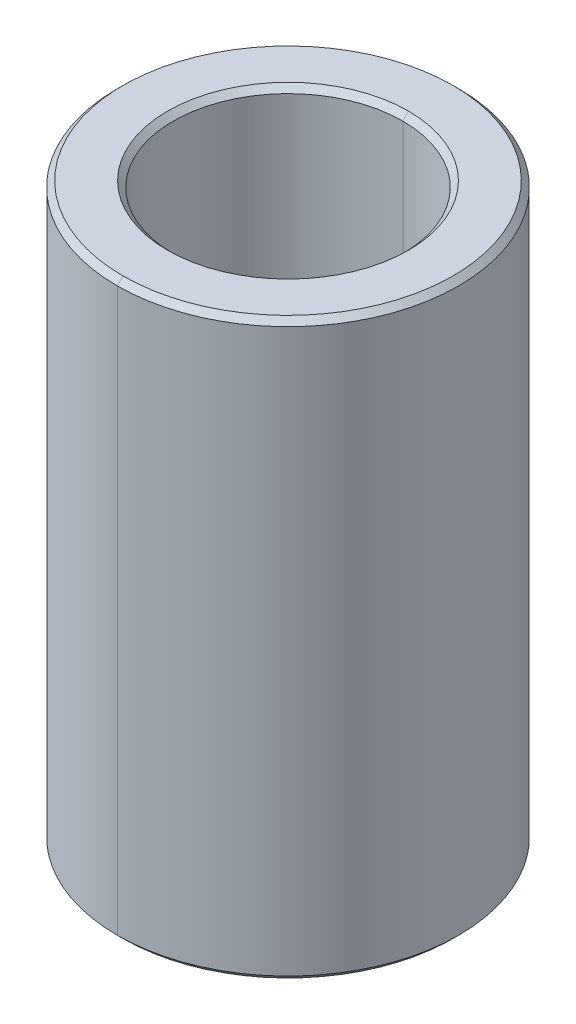
ISO-10303-21;
HEADER;
FILE_DESCRIPTION(('STEP AP214'),'2;1');
FILE_NAME('part.step','',(''),(''),'','','');
FILE_SCHEMA(('AUTOMOTIVE_DESIGN { 1 0 10303 214 1 1 1 1 }'));
ENDSEC;
DATA;
#1=APPLICATION_CONTEXT('core data for automotive mechanical design processes');
#2=APPLICATION_PROTOCOL_DEFINITION('international standard','automotive_design',2000,#1);
#3=PRODUCT_CONTEXT('',#1,'mechanical');
#4=PRODUCT('Part','Part','',(#3));
#5=PRODUCT_RELATED_PRODUCT_CATEGORY('part','',(#4));
#6=PRODUCT_DEFINITION_FORMATION('','',#4);
#7=PRODUCT_DEFINITION_CONTEXT('part definition',#1,'design');
#8=PRODUCT_DEFINITION('design','',#6,#7);
#9=PRODUCT_DEFINITION_SHAPE('','',#8);
#10=(LENGTH_UNIT() NAMED_UNIT(*) SI_UNIT(.MILLI.,.METRE.));
#11=(NAMED_UNIT(*) PLANE_ANGLE_UNIT() SI_UNIT($,.RADIAN.));
#12=(NAMED_UNIT(*) SI_UNIT($,.STERADIAN.) SOLID_ANGLE_UNIT());
#13=UNCERTAINTY_MEASURE_WITH_UNIT(LENGTH_MEASURE(1.E-05),#10,'distance_accuracy_value','');
#14=(GEOMETRIC_REPRESENTATION_CONTEXT(3) GLOBAL_UNCERTAINTY_ASSIGNED_CONTEXT((#13)) GLOBAL_UNIT_ASSIGNED_CONTEXT((#10,
#11,#12)) REPRESENTATION_CONTEXT('',''));
#15=CARTESIAN_POINT('',(0.,0.,0.));
#16=DIRECTION('',(0.,0.,1.));
#17=DIRECTION('',(1.,0.,0.));
#18=AXIS2_PLACEMENT_3D('',#15,#16,#17);
#19=CARTESIAN_POINT('',(0.,4.9,0.));
#20=DIRECTION('',(0.,1.,0.));
#21=DIRECTION('',(0.,0.,1.));
#22=AXIS2_PLACEMENT_3D('',#19,#20,#21);
#23=CONICAL_SURFACE('',#22,2.,0.785398163397448);
#24=DIRECTION('',(0.,0.707106781186548,-0.707106781186548));
#25=VECTOR('',#24,1.);
#26=CARTESIAN_POINT('',(0.,4.9,-2.));
#27=LINE('',#26,#25);
#28=CARTESIAN_POINT('',(0.,4.9,-2.));
#29=VERTEX_POINT('',#28);
#30=CARTESIAN_POINT('',(0.,5.,-2.1));
#31=VERTEX_POINT('',#30);
#32=EDGE_CURVE('E203',#29,#31,#27,.T.);
#33=ORIENTED_EDGE('',*,*,#32,.F.);
#34=CARTESIAN_POINT('',(0.,4.9,0.));
#35=DIRECTION('',(0.,1.,0.));
#36=DIRECTION('',(0.,0.,1.));
#37=AXIS2_PLACEMENT_3D('',#34,#35,#36);
#38=CIRCLE('',#37,2.);
#39=CARTESIAN_POINT('',(0.,4.9,2.));
#40=VERTEX_POINT('',#39);
#41=EDGE_CURVE('E27',#40,#29,#38,.T.);
#42=ORIENTED_EDGE('',*,*,#41,.F.);
#43=DIRECTION('',(0.,0.707106781186548,0.707106781186548));
#44=VECTOR('',#43,1.);
#45=CARTESIAN_POINT('',(0.,4.9,2.));
#46=LINE('',#45,#44);
#47=CARTESIAN_POINT('',(0.,5.,2.1));
#48=VERTEX_POINT('',#47);
#49=EDGE_CURVE('E184',#40,#48,#46,.T.);
#50=ORIENTED_EDGE('',*,*,#49,.T.);
#51=CARTESIAN_POINT('',(0.,5.,0.));
#52=DIRECTION('',(0.,-1.,0.));
#53=DIRECTION('',(0.,0.,1.));
#54=AXIS2_PLACEMENT_3D('',#51,#52,#53);
#55=CIRCLE('',#54,2.1);
#56=EDGE_CURVE('E161',#31,#48,#55,.T.);
#57=ORIENTED_EDGE('',*,*,#56,.F.);
#58=EDGE_LOOP('',(#33,#42,#50,#57));
#59=FACE_BOUND('',#58,.T.);
#60=ADVANCED_FACE('F16',(#59),#23,.F.);
#61=CARTESIAN_POINT('',(0.,-5.,0.));
#62=DIRECTION('',(0.,-1.,0.));
#63=DIRECTION('',(0.,0.,-1.));
#64=AXIS2_PLACEMENT_3D('',#61,#62,#63);
#65=CONICAL_SURFACE('',#64,2.1,0.785398163397443);
#66=DIRECTION('',(0.,-0.707106781186551,0.707106781186545));
#67=VECTOR('',#66,1.);
#68=CARTESIAN_POINT('',(0.,-5.,2.1));
#69=LINE('',#68,#67);
#70=CARTESIAN_POINT('',(0.,-4.9,2.));
#71=VERTEX_POINT('',#70);
#72=CARTESIAN_POINT('',(0.,-5.,2.1));
#73=VERTEX_POINT('',#72);
#74=EDGE_CURVE('E146',#71,#73,#69,.T.);
#75=ORIENTED_EDGE('',*,*,#74,.F.);
#76=CARTESIAN_POINT('',(0.,-4.9,0.));
#77=DIRECTION('',(0.,-1.,0.));
#78=DIRECTION('',(0.,0.,1.));
#79=AXIS2_PLACEMENT_3D('',#76,#77,#78);
#80=CIRCLE('',#79,2.);
#81=CARTESIAN_POINT('',(0.,-4.9,-2.));
#82=VERTEX_POINT('',#81);
#83=EDGE_CURVE('E10',#82,#71,#80,.T.);
#84=ORIENTED_EDGE('',*,*,#83,.F.);
#85=DIRECTION('',(0.,-0.707106781186551,-0.707106781186545));
#86=VECTOR('',#85,1.);
#87=CARTESIAN_POINT('',(0.,-5.,-2.1));
#88=LINE('',#87,#86);
#89=CARTESIAN_POINT('',(0.,-5.,-2.1));
#90=VERTEX_POINT('',#89);
#91=EDGE_CURVE('E138',#82,#90,#88,.T.);
#92=ORIENTED_EDGE('',*,*,#91,.T.);
#93=CARTESIAN_POINT('',(0.,-5.,0.));
#94=DIRECTION('',(0.,1.,0.));
#95=DIRECTION('',(0.,0.,1.));
#96=AXIS2_PLACEMENT_3D('',#93,#94,#95);
#97=CIRCLE('',#96,2.1);
#98=EDGE_CURVE('E125',#73,#90,#97,.T.);
#99=ORIENTED_EDGE('',*,*,#98,.F.);
#100=EDGE_LOOP('',(#75,#84,#92,#99));
#101=FACE_BOUND('',#100,.T.);
#102=ADVANCED_FACE('F139',(#101),#65,.F.);
#103=CARTESIAN_POINT('',(0.,5.,0.));
#104=DIRECTION('',(0.,-1.,0.));
#105=DIRECTION('',(0.,0.,-1.));
#106=AXIS2_PLACEMENT_3D('',#103,#104,#105);
#107=CONICAL_SURFACE('',#106,2.875,0.78539816339744);
#108=DIRECTION('',(0.,-0.707106781186554,0.707106781186542));
#109=VECTOR('',#108,1.);
#110=CARTESIAN_POINT('',(0.,5.,2.875));
#111=LINE('',#110,#109);
#112=CARTESIAN_POINT('',(0.,5.,2.875));
#113=VERTEX_POINT('',#112);
#114=CARTESIAN_POINT('',(0.,4.9,2.975));
#115=VERTEX_POINT('',#114);
#116=EDGE_CURVE('E196',#113,#115,#111,.T.);
#117=ORIENTED_EDGE('',*,*,#116,.F.);
#118=CARTESIAN_POINT('',(0.,5.,0.));
#119=DIRECTION('',(0.,1.,0.));
#120=DIRECTION('',(0.,0.,1.));
#121=AXIS2_PLACEMENT_3D('',#118,#119,#120);
#122=CIRCLE('',#121,2.875);
#123=CARTESIAN_POINT('',(0.,5.,-2.875));
#124=VERTEX_POINT('',#123);
#125=EDGE_CURVE('E119',#124,#113,#122,.T.);
#126=ORIENTED_EDGE('',*,*,#125,.F.);
#127=DIRECTION('',(0.,-0.707106781186554,-0.707106781186542));
#128=VECTOR('',#127,1.);
#129=CARTESIAN_POINT('',(0.,5.,-2.875));
#130=LINE('',#129,#128);
#131=CARTESIAN_POINT('',(0.,4.9,-2.975));
#132=VERTEX_POINT('',#131);
#133=EDGE_CURVE('E195',#124,#132,#130,.T.);
#134=ORIENTED_EDGE('',*,*,#133,.T.);
#135=CARTESIAN_POINT('',(0.,4.9,0.));
#136=DIRECTION('',(0.,-1.,0.));
#137=DIRECTION('',(0.,0.,1.));
#138=AXIS2_PLACEMENT_3D('',#135,#136,#137);
#139=CIRCLE('',#138,2.975);
#140=EDGE_CURVE('E68',#115,#132,#139,.T.);
#141=ORIENTED_EDGE('',*,*,#140,.F.);
#142=EDGE_LOOP('',(#117,#126,#134,#141));
#143=FACE_BOUND('',#142,.T.);
#144=ADVANCED_FACE('F234',(#143),#107,.T.);
#145=CARTESIAN_POINT('',(0.,-4.9,0.));
#146=DIRECTION('',(0.,1.,0.));
#147=DIRECTION('',(0.,0.,1.));
#148=AXIS2_PLACEMENT_3D('',#145,#146,#147);
#149=CONICAL_SURFACE('',#148,2.975,0.785398163397443);
#150=DIRECTION('',(0.,0.707106781186551,-0.707106781186545));
#151=VECTOR('',#150,1.);
#152=CARTESIAN_POINT('',(0.,-4.9,-2.975));
#153=LINE('',#152,#151);
#154=CARTESIAN_POINT('',(0.,-5.,-2.875));
#155=VERTEX_POINT('',#154);
#156=CARTESIAN_POINT('',(0.,-4.9,-2.975));
#157=VERTEX_POINT('',#156);
#158=EDGE_CURVE('E155',#155,#157,#153,.T.);
#159=ORIENTED_EDGE('',*,*,#158,.F.);
#160=CARTESIAN_POINT('',(0.,-5.,0.));
#161=DIRECTION('',(0.,-1.,0.));
#162=DIRECTION('',(0.,0.,1.));
#163=AXIS2_PLACEMENT_3D('',#160,#161,#162);
#164=CIRCLE('',#163,2.875);
#165=CARTESIAN_POINT('',(0.,-5.,2.875));
#166=VERTEX_POINT('',#165);
#167=EDGE_CURVE('E135',#166,#155,#164,.T.);
#168=ORIENTED_EDGE('',*,*,#167,.F.);
#169=DIRECTION('',(0.,0.707106781186551,0.707106781186545));
#170=VECTOR('',#169,1.);
#171=CARTESIAN_POINT('',(0.,-4.9,2.975));
#172=LINE('',#171,#170);
#173=CARTESIAN_POINT('',(0.,-4.9,2.975));
#174=VERTEX_POINT('',#173);
#175=EDGE_CURVE('E180',#166,#174,#172,.T.);
#176=ORIENTED_EDGE('',*,*,#175,.T.);
#177=CARTESIAN_POINT('',(0.,-4.9,0.));
#178=DIRECTION('',(0.,1.,0.));
#179=DIRECTION('',(0.,0.,1.));
#180=AXIS2_PLACEMENT_3D('',#177,#178,#179);
#181=CIRCLE('',#180,2.975);
#182=EDGE_CURVE('E42',#157,#174,#181,.T.);
#183=ORIENTED_EDGE('',*,*,#182,.F.);
#184=EDGE_LOOP('',(#159,#168,#176,#183));
#185=FACE_BOUND('',#184,.T.);
#186=ADVANCED_FACE('F236',(#185),#149,.T.);
#187=CARTESIAN_POINT('',(0.,5.,0.));
#188=DIRECTION('',(0.,-1.,0.));
#189=DIRECTION('',(0.,0.,-1.));
#190=AXIS2_PLACEMENT_3D('',#187,#188,#189);
#191=CYLINDRICAL_SURFACE('',#190,2.);
#192=DIRECTION('',(0.,-1.,0.));
#193=VECTOR('',#192,1.);
#194=CARTESIAN_POINT('',(0.,5.,2.));
#195=LINE('',#194,#193);
#196=EDGE_CURVE('E173',#40,#71,#195,.T.);
#197=ORIENTED_EDGE('',*,*,#196,.F.);
#198=ORIENTED_EDGE('',*,*,#41,.T.);
#199=DIRECTION('',(0.,-1.,0.));
#200=VECTOR('',#199,1.);
#201=CARTESIAN_POINT('',(0.,5.,-2.));
#202=LINE('',#201,#200);
#203=EDGE_CURVE('E170',#29,#82,#202,.T.);
#204=ORIENTED_EDGE('',*,*,#203,.T.);
#205=ORIENTED_EDGE('',*,*,#83,.T.);
#206=EDGE_LOOP('',(#197,#198,#204,#205));
#207=FACE_BOUND('',#206,.T.);
#208=ADVANCED_FACE('F243',(#207),#191,.F.);
#209=CARTESIAN_POINT('',(0.,5.,0.));
#210=DIRECTION('',(0.,-1.,0.));
#211=DIRECTION('',(0.,0.,-1.));
#212=AXIS2_PLACEMENT_3D('',#209,#210,#211);
#213=CYLINDRICAL_SURFACE('',#212,2.975);
#214=DIRECTION('',(0.,-1.,0.));
#215=VECTOR('',#214,1.);
#216=CARTESIAN_POINT('',(0.,5.,2.975));
#217=LINE('',#216,#215);
#218=EDGE_CURVE('E167',#115,#174,#217,.T.);
#219=ORIENTED_EDGE('',*,*,#218,.F.);
#220=ORIENTED_EDGE('',*,*,#140,.T.);
#221=DIRECTION('',(0.,-1.,0.));
#222=VECTOR('',#221,1.);
#223=CARTESIAN_POINT('',(0.,5.,-2.975));
#224=LINE('',#223,#222);
#225=EDGE_CURVE('E164',#132,#157,#224,.T.);
#226=ORIENTED_EDGE('',*,*,#225,.T.);
#227=ORIENTED_EDGE('',*,*,#182,.T.);
#228=EDGE_LOOP('',(#219,#220,#226,#227));
#229=FACE_BOUND('',#228,.T.);
#230=ADVANCED_FACE('F273',(#229),#213,.T.);
#231=CARTESIAN_POINT('',(0.,-5.,0.));
#232=DIRECTION('',(0.,1.,0.));
#233=DIRECTION('',(1.,0.,0.));
#234=AXIS2_PLACEMENT_3D('',#231,#232,#233);
#235=PLANE('',#234);
#236=CARTESIAN_POINT('',(0.,-5.,0.));
#237=DIRECTION('',(0.,1.,0.));
#238=DIRECTION('',(0.,0.,1.));
#239=AXIS2_PLACEMENT_3D('',#236,#237,#238);
#240=CIRCLE('',#239,2.1);
#241=EDGE_CURVE('E130',#90,#73,#240,.T.);
#242=ORIENTED_EDGE('',*,*,#241,.T.);
#243=ORIENTED_EDGE('',*,*,#98,.T.);
#244=EDGE_LOOP('',(#242,#243));
#245=FACE_BOUND('',#244,.T.);
#246=ORIENTED_EDGE('',*,*,#167,.T.);
#247=CARTESIAN_POINT('',(0.,-5.,0.));
#248=DIRECTION('',(0.,-1.,0.));
#249=DIRECTION('',(0.,0.,1.));
#250=AXIS2_PLACEMENT_3D('',#247,#248,#249);
#251=CIRCLE('',#250,2.875);
#252=EDGE_CURVE('E159',#155,#166,#251,.T.);
#253=ORIENTED_EDGE('',*,*,#252,.T.);
#254=EDGE_LOOP('',(#246,#253));
#255=FACE_BOUND('',#254,.T.);
#256=ADVANCED_FACE('F127',(#245,#255),#235,.F.);
#257=CARTESIAN_POINT('',(0.,5.,0.));
#258=DIRECTION('',(0.,1.,0.));
#259=DIRECTION('',(1.,0.,0.));
#260=AXIS2_PLACEMENT_3D('',#257,#258,#259);
#261=PLANE('',#260);
#262=CARTESIAN_POINT('',(0.,5.,0.));
#263=DIRECTION('',(0.,-1.,0.));
#264=DIRECTION('',(0.,0.,1.));
#265=AXIS2_PLACEMENT_3D('',#262,#263,#264);
#266=CIRCLE('',#265,2.1);
#267=EDGE_CURVE('E187',#48,#31,#266,.T.);
#268=ORIENTED_EDGE('',*,*,#267,.T.);
#269=ORIENTED_EDGE('',*,*,#56,.T.);
#270=EDGE_LOOP('',(#268,#269));
#271=FACE_BOUND('',#270,.T.);
#272=ORIENTED_EDGE('',*,*,#125,.T.);
#273=CARTESIAN_POINT('',(0.,5.,0.));
#274=DIRECTION('',(0.,1.,0.));
#275=DIRECTION('',(0.,0.,1.));
#276=AXIS2_PLACEMENT_3D('',#273,#274,#275);
#277=CIRCLE('',#276,2.875);
#278=EDGE_CURVE('E20',#113,#124,#277,.T.);
#279=ORIENTED_EDGE('',*,*,#278,.T.);
#280=EDGE_LOOP('',(#272,#279));
#281=FACE_BOUND('',#280,.T.);
#282=ADVANCED_FACE('F232',(#271,#281),#261,.T.);
#283=CARTESIAN_POINT('',(0.,5.,0.));
#284=DIRECTION('',(0.,-1.,0.));
#285=DIRECTION('',(0.,0.,-1.));
#286=AXIS2_PLACEMENT_3D('',#283,#284,#285);
#287=CYLINDRICAL_SURFACE('',#286,2.975);
#288=CARTESIAN_POINT('',(0.,4.9,0.));
#289=DIRECTION('',(0.,-1.,0.));
#290=DIRECTION('',(0.,0.,1.));
#291=AXIS2_PLACEMENT_3D('',#288,#289,#290);
#292=CIRCLE('',#291,2.975);
#293=EDGE_CURVE('E191',#132,#115,#292,.T.);
#294=ORIENTED_EDGE('',*,*,#293,.T.);
#295=ORIENTED_EDGE('',*,*,#218,.T.);
#296=CARTESIAN_POINT('',(0.,-4.9,0.));
#297=DIRECTION('',(0.,1.,0.));
#298=DIRECTION('',(0.,0.,1.));
#299=AXIS2_PLACEMENT_3D('',#296,#297,#298);
#300=CIRCLE('',#299,2.975);
#301=EDGE_CURVE('E158',#174,#157,#300,.T.);
#302=ORIENTED_EDGE('',*,*,#301,.T.);
#303=ORIENTED_EDGE('',*,*,#225,.F.);
#304=EDGE_LOOP('',(#294,#295,#302,#303));
#305=FACE_BOUND('',#304,.T.);
#306=ADVANCED_FACE('F254',(#305),#287,.T.);
#307=CARTESIAN_POINT('',(0.,5.,0.));
#308=DIRECTION('',(0.,-1.,0.));
#309=DIRECTION('',(0.,0.,-1.));
#310=AXIS2_PLACEMENT_3D('',#307,#308,#309);
#311=CYLINDRICAL_SURFACE('',#310,2.);
#312=CARTESIAN_POINT('',(0.,4.9,0.));
#313=DIRECTION('',(0.,1.,0.));
#314=DIRECTION('',(0.,0.,1.));
#315=AXIS2_PLACEMENT_3D('',#312,#313,#314);
#316=CIRCLE('',#315,2.);
#317=EDGE_CURVE('E204',#29,#40,#316,.T.);
#318=ORIENTED_EDGE('',*,*,#317,.T.);
#319=ORIENTED_EDGE('',*,*,#196,.T.);
#320=CARTESIAN_POINT('',(0.,-4.9,0.));
#321=DIRECTION('',(0.,-1.,0.));
#322=DIRECTION('',(0.,0.,1.));
#323=AXIS2_PLACEMENT_3D('',#320,#321,#322);
#324=CIRCLE('',#323,2.);
#325=EDGE_CURVE('E152',#71,#82,#324,.T.);
#326=ORIENTED_EDGE('',*,*,#325,.T.);
#327=ORIENTED_EDGE('',*,*,#203,.F.);
#328=EDGE_LOOP('',(#318,#319,#326,#327));
#329=FACE_BOUND('',#328,.T.);
#330=ADVANCED_FACE('F261',(#329),#311,.F.);
#331=CARTESIAN_POINT('',(0.,-4.9,0.));
#332=DIRECTION('',(0.,1.,0.));
#333=DIRECTION('',(0.,0.,1.));
#334=AXIS2_PLACEMENT_3D('',#331,#332,#333);
#335=CONICAL_SURFACE('',#334,2.975,0.785398163397443);
#336=ORIENTED_EDGE('',*,*,#252,.F.);
#337=ORIENTED_EDGE('',*,*,#158,.T.);
#338=ORIENTED_EDGE('',*,*,#301,.F.);
#339=ORIENTED_EDGE('',*,*,#175,.F.);
#340=EDGE_LOOP('',(#336,#337,#338,#339));
#341=FACE_BOUND('',#340,.T.);
#342=ADVANCED_FACE('F259',(#341),#335,.T.);
#343=CARTESIAN_POINT('',(0.,5.,0.));
#344=DIRECTION('',(0.,-1.,0.));
#345=DIRECTION('',(0.,0.,-1.));
#346=AXIS2_PLACEMENT_3D('',#343,#344,#345);
#347=CONICAL_SURFACE('',#346,2.875,0.78539816339744);
#348=ORIENTED_EDGE('',*,*,#278,.F.);
#349=ORIENTED_EDGE('',*,*,#116,.T.);
#350=ORIENTED_EDGE('',*,*,#293,.F.);
#351=ORIENTED_EDGE('',*,*,#133,.F.);
#352=EDGE_LOOP('',(#348,#349,#350,#351));
#353=FACE_BOUND('',#352,.T.);
#354=ADVANCED_FACE('F18',(#353),#347,.T.);
#355=CARTESIAN_POINT('',(0.,-5.,0.));
#356=DIRECTION('',(0.,-1.,0.));
#357=DIRECTION('',(0.,0.,-1.));
#358=AXIS2_PLACEMENT_3D('',#355,#356,#357);
#359=CONICAL_SURFACE('',#358,2.1,0.785398163397443);
#360=ORIENTED_EDGE('',*,*,#325,.F.);
#361=ORIENTED_EDGE('',*,*,#74,.T.);
#362=ORIENTED_EDGE('',*,*,#241,.F.);
#363=ORIENTED_EDGE('',*,*,#91,.F.);
#364=EDGE_LOOP('',(#360,#361,#362,#363));
#365=FACE_BOUND('',#364,.T.);
#366=ADVANCED_FACE('F145',(#365),#359,.F.);
#367=CARTESIAN_POINT('',(0.,4.9,0.));
#368=DIRECTION('',(0.,1.,0.));
#369=DIRECTION('',(0.,0.,1.));
#370=AXIS2_PLACEMENT_3D('',#367,#368,#369);
#371=CONICAL_SURFACE('',#370,2.,0.785398163397448);
#372=ORIENTED_EDGE('',*,*,#317,.F.);
#373=ORIENTED_EDGE('',*,*,#32,.T.);
#374=ORIENTED_EDGE('',*,*,#267,.F.);
#375=ORIENTED_EDGE('',*,*,#49,.F.);
#376=EDGE_LOOP('',(#372,#373,#374,#375));
#377=FACE_BOUND('',#376,.T.);
#378=ADVANCED_FACE('F258',(#377),#371,.F.);
#379=CLOSED_SHELL('',(#60,#102,#144,#186,#208,#230,#256,#282,#306,#330,#342,#354,#366,#378));
#380=MANIFOLD_SOLID_BREP('B1',#379);
#381=ADVANCED_BREP_SHAPE_REPRESENTATION('',(#18,#380),#14);
#382=SHAPE_DEFINITION_REPRESENTATION(#9,#381);
ENDSEC;
END-ISO-10303-21;
